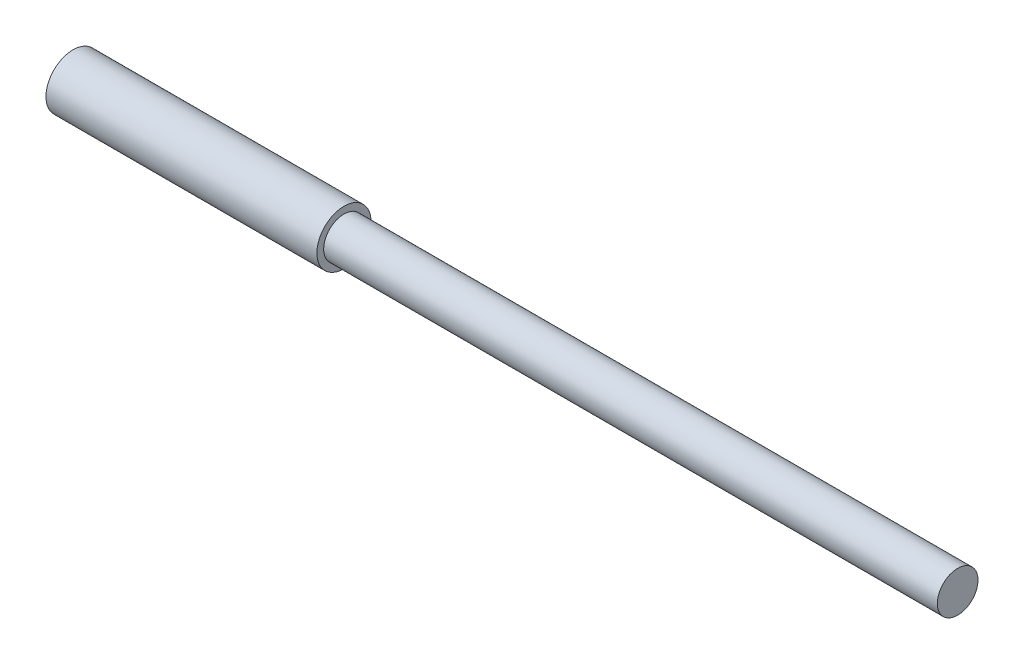
ISO-10303-21;
HEADER;
FILE_DESCRIPTION(('STEP AP214'),'2;1');
FILE_NAME('part.step','',(''),(''),'','','');
FILE_SCHEMA(('AUTOMOTIVE_DESIGN { 1 0 10303 214 1 1 1 1 }'));
ENDSEC;
DATA;
#1=APPLICATION_CONTEXT('core data for automotive mechanical design processes');
#2=APPLICATION_PROTOCOL_DEFINITION('international standard','automotive_design',2000,#1);
#3=PRODUCT_CONTEXT('',#1,'mechanical');
#4=PRODUCT('Part','Part','',(#3));
#5=PRODUCT_RELATED_PRODUCT_CATEGORY('part','',(#4));
#6=PRODUCT_DEFINITION_FORMATION('','',#4);
#7=PRODUCT_DEFINITION_CONTEXT('part definition',#1,'design');
#8=PRODUCT_DEFINITION('design','',#6,#7);
#9=PRODUCT_DEFINITION_SHAPE('','',#8);
#10=(LENGTH_UNIT() NAMED_UNIT(*) SI_UNIT(.MILLI.,.METRE.));
#11=(NAMED_UNIT(*) PLANE_ANGLE_UNIT() SI_UNIT($,.RADIAN.));
#12=(NAMED_UNIT(*) SI_UNIT($,.STERADIAN.) SOLID_ANGLE_UNIT());
#13=UNCERTAINTY_MEASURE_WITH_UNIT(LENGTH_MEASURE(1.E-05),#10,'distance_accuracy_value','');
#14=(GEOMETRIC_REPRESENTATION_CONTEXT(3) GLOBAL_UNCERTAINTY_ASSIGNED_CONTEXT((#13)) GLOBAL_UNIT_ASSIGNED_CONTEXT((#10,
#11,#12)) REPRESENTATION_CONTEXT('',''));
#15=CARTESIAN_POINT('',(0.,0.,0.));
#16=DIRECTION('',(0.,0.,1.));
#17=DIRECTION('',(1.,0.,0.));
#18=AXIS2_PLACEMENT_3D('',#15,#16,#17);
#19=CARTESIAN_POINT('',(20.,0.,0.));
#20=DIRECTION('',(1.,0.,0.));
#21=DIRECTION('',(0.,0.,-1.));
#22=AXIS2_PLACEMENT_3D('',#19,#20,#21);
#23=PLANE('',#22);
#24=CARTESIAN_POINT('',(20.,0.,0.));
#25=DIRECTION('',(1.,0.,0.));
#26=DIRECTION('',(0.,0.,-1.));
#27=AXIS2_PLACEMENT_3D('',#24,#25,#26);
#28=CIRCLE('',#27,2.);
#29=CARTESIAN_POINT('',(20.,0.,-2.));
#30=VERTEX_POINT('',#29);
#31=EDGE_CURVE('E10',#30,#30,#28,.T.);
#32=ORIENTED_EDGE('',*,*,#31,.T.);
#33=EDGE_LOOP('',(#32));
#34=FACE_BOUND('',#33,.T.);
#35=CARTESIAN_POINT('',(20.,0.,0.));
#36=DIRECTION('',(1.,0.,0.));
#37=DIRECTION('',(0.,0.,-1.));
#38=AXIS2_PLACEMENT_3D('',#35,#36,#37);
#39=CIRCLE('',#38,1.5);
#40=CARTESIAN_POINT('',(20.,0.,-1.5));
#41=VERTEX_POINT('',#40);
#42=EDGE_CURVE('E41',#41,#41,#39,.T.);
#43=ORIENTED_EDGE('',*,*,#42,.F.);
#44=EDGE_LOOP('',(#43));
#45=FACE_BOUND('',#44,.T.);
#46=ADVANCED_FACE('F28',(#34,#45),#23,.T.);
#47=CARTESIAN_POINT('',(20.,0.,0.));
#48=DIRECTION('',(-1.,0.,0.));
#49=DIRECTION('',(0.,0.,1.));
#50=AXIS2_PLACEMENT_3D('',#47,#48,#49);
#51=CYLINDRICAL_SURFACE('',#50,2.);
#52=ORIENTED_EDGE('',*,*,#31,.F.);
#53=EDGE_LOOP('',(#52));
#54=FACE_BOUND('',#53,.T.);
#55=CARTESIAN_POINT('',(0.,0.,0.));
#56=DIRECTION('',(1.,0.,0.));
#57=DIRECTION('',(0.,0.,-1.));
#58=AXIS2_PLACEMENT_3D('',#55,#56,#57);
#59=CIRCLE('',#58,2.);
#60=CARTESIAN_POINT('',(0.,0.,-2.));
#61=VERTEX_POINT('',#60);
#62=EDGE_CURVE('E32',#61,#61,#59,.T.);
#63=ORIENTED_EDGE('',*,*,#62,.T.);
#64=EDGE_LOOP('',(#63));
#65=FACE_BOUND('',#64,.T.);
#66=ADVANCED_FACE('F30',(#54,#65),#51,.T.);
#67=CARTESIAN_POINT('',(0.,0.,0.));
#68=DIRECTION('',(1.,0.,0.));
#69=DIRECTION('',(0.,0.,-1.));
#70=AXIS2_PLACEMENT_3D('',#67,#68,#69);
#71=PLANE('',#70);
#72=ORIENTED_EDGE('',*,*,#62,.F.);
#73=EDGE_LOOP('',(#72));
#74=FACE_BOUND('',#73,.T.);
#75=ADVANCED_FACE('F52',(#74),#71,.F.);
#76=CARTESIAN_POINT('',(65.3,0.,0.));
#77=DIRECTION('',(-1.,0.,0.));
#78=DIRECTION('',(0.,0.,1.));
#79=AXIS2_PLACEMENT_3D('',#76,#77,#78);
#80=CYLINDRICAL_SURFACE('',#79,1.5);
#81=CARTESIAN_POINT('',(65.3,0.,0.));
#82=DIRECTION('',(1.,0.,0.));
#83=DIRECTION('',(0.,0.,-1.));
#84=AXIS2_PLACEMENT_3D('',#81,#82,#83);
#85=CIRCLE('',#84,1.5);
#86=CARTESIAN_POINT('',(65.3,0.,-1.5));
#87=VERTEX_POINT('',#86);
#88=EDGE_CURVE('E39',#87,#87,#85,.T.);
#89=ORIENTED_EDGE('',*,*,#88,.F.);
#90=EDGE_LOOP('',(#89));
#91=FACE_BOUND('',#90,.T.);
#92=ORIENTED_EDGE('',*,*,#42,.T.);
#93=EDGE_LOOP('',(#92));
#94=FACE_BOUND('',#93,.T.);
#95=ADVANCED_FACE('F49',(#91,#94),#80,.T.);
#96=CARTESIAN_POINT('',(65.3,0.,0.));
#97=DIRECTION('',(1.,0.,0.));
#98=DIRECTION('',(0.,0.,-1.));
#99=AXIS2_PLACEMENT_3D('',#96,#97,#98);
#100=PLANE('',#99);
#101=ORIENTED_EDGE('',*,*,#88,.T.);
#102=EDGE_LOOP('',(#101));
#103=FACE_BOUND('',#102,.T.);
#104=ADVANCED_FACE('F47',(#103),#100,.T.);
#105=CLOSED_SHELL('',(#46,#66,#75,#95,#104));
#106=MANIFOLD_SOLID_BREP('B2',#105);
#107=ADVANCED_BREP_SHAPE_REPRESENTATION('',(#18,#106),#14);
#108=SHAPE_DEFINITION_REPRESENTATION(#9,#107);
ENDSEC;
END-ISO-10303-21;
